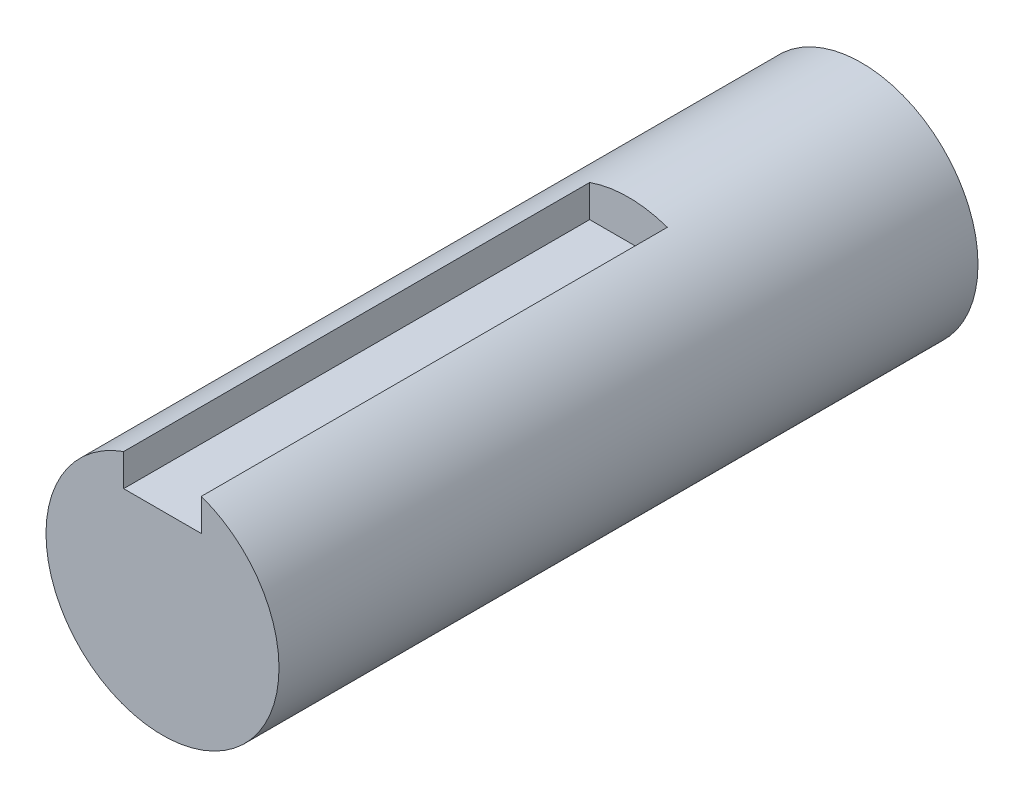
ISO-10303-21;
HEADER;
FILE_DESCRIPTION(('STEP AP214'),'2;1');
FILE_NAME('part.step','',(''),(''),'','','');
FILE_SCHEMA(('AUTOMOTIVE_DESIGN { 1 0 10303 214 1 1 1 1 }'));
ENDSEC;
DATA;
#1=APPLICATION_CONTEXT('core data for automotive mechanical design processes');
#2=APPLICATION_PROTOCOL_DEFINITION('international standard','automotive_design',2000,#1);
#3=PRODUCT_CONTEXT('',#1,'mechanical');
#4=PRODUCT('Part','Part','',(#3));
#5=PRODUCT_RELATED_PRODUCT_CATEGORY('part','',(#4));
#6=PRODUCT_DEFINITION_FORMATION('','',#4);
#7=PRODUCT_DEFINITION_CONTEXT('part definition',#1,'design');
#8=PRODUCT_DEFINITION('design','',#6,#7);
#9=PRODUCT_DEFINITION_SHAPE('','',#8);
#10=(LENGTH_UNIT() NAMED_UNIT(*) SI_UNIT(.MILLI.,.METRE.));
#11=(NAMED_UNIT(*) PLANE_ANGLE_UNIT() SI_UNIT($,.RADIAN.));
#12=(NAMED_UNIT(*) SI_UNIT($,.STERADIAN.) SOLID_ANGLE_UNIT());
#13=UNCERTAINTY_MEASURE_WITH_UNIT(LENGTH_MEASURE(1.E-05),#10,'distance_accuracy_value','');
#14=(GEOMETRIC_REPRESENTATION_CONTEXT(3) GLOBAL_UNCERTAINTY_ASSIGNED_CONTEXT((#13)) GLOBAL_UNIT_ASSIGNED_CONTEXT((#10,
#11,#12)) REPRESENTATION_CONTEXT('',''));
#15=CARTESIAN_POINT('',(0.,0.,0.));
#16=DIRECTION('',(0.,0.,1.));
#17=DIRECTION('',(1.,0.,0.));
#18=AXIS2_PLACEMENT_3D('',#15,#16,#17);
#19=CARTESIAN_POINT('',(0.,0.,45.));
#20=DIRECTION('',(0.,0.,-1.));
#21=DIRECTION('',(-1.,0.,0.));
#22=AXIS2_PLACEMENT_3D('',#19,#20,#21);
#23=CYLINDRICAL_SURFACE('',#22,7.5);
#24=CARTESIAN_POINT('',(0.,0.,15.));
#25=DIRECTION('',(0.,0.,-1.));
#26=DIRECTION('',(-1.,0.,0.));
#27=AXIS2_PLACEMENT_3D('',#24,#25,#26);
#28=CIRCLE('',#27,7.5);
#29=CARTESIAN_POINT('',(-2.5,7.07106781186548,15.));
#30=VERTEX_POINT('',#29);
#31=CARTESIAN_POINT('',(2.5,7.07106781186548,15.));
#32=VERTEX_POINT('',#31);
#33=EDGE_CURVE('E11',#30,#32,#28,.T.);
#34=ORIENTED_EDGE('',*,*,#33,.T.);
#35=DIRECTION('',(0.,0.,-1.));
#36=VECTOR('',#35,1.);
#37=CARTESIAN_POINT('',(2.5,7.07106781186547,45.));
#38=LINE('',#37,#36);
#39=CARTESIAN_POINT('',(2.5,7.07106781186548,45.));
#40=VERTEX_POINT('',#39);
#41=EDGE_CURVE('E61',#32,#40,#38,.F.);
#42=ORIENTED_EDGE('',*,*,#41,.T.);
#43=CARTESIAN_POINT('',(0.,0.,45.));
#44=DIRECTION('',(0.,0.,1.));
#45=DIRECTION('',(1.,0.,0.));
#46=AXIS2_PLACEMENT_3D('',#43,#44,#45);
#47=CIRCLE('',#46,7.5);
#48=CARTESIAN_POINT('',(-2.5,7.07106781186548,45.));
#49=VERTEX_POINT('',#48);
#50=EDGE_CURVE('E107',#49,#40,#47,.T.);
#51=ORIENTED_EDGE('',*,*,#50,.F.);
#52=DIRECTION('',(0.,0.,-1.));
#53=VECTOR('',#52,1.);
#54=CARTESIAN_POINT('',(-2.5,7.07106781186547,45.));
#55=LINE('',#54,#53);
#56=EDGE_CURVE('E53',#49,#30,#55,.T.);
#57=ORIENTED_EDGE('',*,*,#56,.T.);
#58=EDGE_LOOP('',(#34,#42,#51,#57));
#59=FACE_BOUND('',#58,.T.);
#60=CARTESIAN_POINT('',(0.,0.,0.));
#61=DIRECTION('',(0.,0.,1.));
#62=DIRECTION('',(1.,0.,0.));
#63=AXIS2_PLACEMENT_3D('',#60,#61,#62);
#64=CIRCLE('',#63,7.5);
#65=CARTESIAN_POINT('',(7.5,0.,0.));
#66=VERTEX_POINT('',#65);
#67=EDGE_CURVE('E106',#66,#66,#64,.T.);
#68=ORIENTED_EDGE('',*,*,#67,.T.);
#69=EDGE_LOOP('',(#68));
#70=FACE_BOUND('',#69,.T.);
#71=ADVANCED_FACE('F39',(#59,#70),#23,.T.);
#72=CARTESIAN_POINT('',(0.,0.,45.));
#73=DIRECTION('',(0.,0.,1.));
#74=DIRECTION('',(1.,0.,0.));
#75=AXIS2_PLACEMENT_3D('',#72,#73,#74);
#76=PLANE('',#75);
#77=DIRECTION('',(0.,1.,0.));
#78=VECTOR('',#77,1.);
#79=CARTESIAN_POINT('',(2.5,5.,45.));
#80=LINE('',#79,#78);
#81=CARTESIAN_POINT('',(2.5,5.,45.));
#82=VERTEX_POINT('',#81);
#83=EDGE_CURVE('E99',#82,#40,#80,.T.);
#84=ORIENTED_EDGE('',*,*,#83,.F.);
#85=DIRECTION('',(1.,0.,0.));
#86=VECTOR('',#85,1.);
#87=CARTESIAN_POINT('',(-2.5,5.,45.));
#88=LINE('',#87,#86);
#89=CARTESIAN_POINT('',(-2.5,5.,45.));
#90=VERTEX_POINT('',#89);
#91=EDGE_CURVE('E101',#90,#82,#88,.T.);
#92=ORIENTED_EDGE('',*,*,#91,.F.);
#93=DIRECTION('',(0.,-1.,0.));
#94=VECTOR('',#93,1.);
#95=CARTESIAN_POINT('',(-2.5,0.,45.));
#96=LINE('',#95,#94);
#97=EDGE_CURVE('E46',#49,#90,#96,.T.);
#98=ORIENTED_EDGE('',*,*,#97,.F.);
#99=ORIENTED_EDGE('',*,*,#50,.T.);
#100=EDGE_LOOP('',(#84,#92,#98,#99));
#101=FACE_BOUND('',#100,.T.);
#102=ADVANCED_FACE('F116',(#101),#76,.T.);
#103=CARTESIAN_POINT('',(0.,0.,0.));
#104=DIRECTION('',(0.,0.,1.));
#105=DIRECTION('',(1.,0.,0.));
#106=AXIS2_PLACEMENT_3D('',#103,#104,#105);
#107=PLANE('',#106);
#108=ORIENTED_EDGE('',*,*,#67,.F.);
#109=EDGE_LOOP('',(#108));
#110=FACE_BOUND('',#109,.T.);
#111=ADVANCED_FACE('F114',(#110),#107,.F.);
#112=CARTESIAN_POINT('',(0.,0.,15.));
#113=DIRECTION('',(0.,0.,-1.));
#114=DIRECTION('',(-1.,0.,0.));
#115=AXIS2_PLACEMENT_3D('',#112,#113,#114);
#116=PLANE('',#115);
#117=DIRECTION('',(0.,-1.,0.));
#118=VECTOR('',#117,1.);
#119=CARTESIAN_POINT('',(-2.5,5.,15.));
#120=LINE('',#119,#118);
#121=CARTESIAN_POINT('',(-2.5,5.,15.));
#122=VERTEX_POINT('',#121);
#123=EDGE_CURVE('E80',#30,#122,#120,.T.);
#124=ORIENTED_EDGE('',*,*,#123,.T.);
#125=DIRECTION('',(1.,0.,0.));
#126=VECTOR('',#125,1.);
#127=CARTESIAN_POINT('',(-2.5,5.,15.));
#128=LINE('',#127,#126);
#129=CARTESIAN_POINT('',(2.5,5.,15.));
#130=VERTEX_POINT('',#129);
#131=EDGE_CURVE('E84',#122,#130,#128,.T.);
#132=ORIENTED_EDGE('',*,*,#131,.T.);
#133=DIRECTION('',(0.,1.,0.));
#134=VECTOR('',#133,1.);
#135=CARTESIAN_POINT('',(2.5,5.,15.));
#136=LINE('',#135,#134);
#137=EDGE_CURVE('E85',#130,#32,#136,.T.);
#138=ORIENTED_EDGE('',*,*,#137,.T.);
#139=ORIENTED_EDGE('',*,*,#33,.F.);
#140=EDGE_LOOP('',(#124,#132,#138,#139));
#141=FACE_BOUND('',#140,.T.);
#142=ADVANCED_FACE('F82',(#141),#116,.F.);
#143=CARTESIAN_POINT('',(2.5,5.,15.));
#144=DIRECTION('',(1.,0.,0.));
#145=DIRECTION('',(0.,0.,-1.));
#146=AXIS2_PLACEMENT_3D('',#143,#144,#145);
#147=PLANE('',#146);
#148=ORIENTED_EDGE('',*,*,#137,.F.);
#149=DIRECTION('',(0.,0.,1.));
#150=VECTOR('',#149,1.);
#151=CARTESIAN_POINT('',(2.5,5.,15.));
#152=LINE('',#151,#150);
#153=EDGE_CURVE('E93',#130,#82,#152,.T.);
#154=ORIENTED_EDGE('',*,*,#153,.T.);
#155=ORIENTED_EDGE('',*,*,#83,.T.);
#156=ORIENTED_EDGE('',*,*,#41,.F.);
#157=EDGE_LOOP('',(#148,#154,#155,#156));
#158=FACE_BOUND('',#157,.T.);
#159=ADVANCED_FACE('F121',(#158),#147,.F.);
#160=CARTESIAN_POINT('',(-2.5,5.,15.));
#161=DIRECTION('',(-1.,0.,0.));
#162=DIRECTION('',(0.,0.,1.));
#163=AXIS2_PLACEMENT_3D('',#160,#161,#162);
#164=PLANE('',#163);
#165=ORIENTED_EDGE('',*,*,#97,.T.);
#166=DIRECTION('',(0.,0.,1.));
#167=VECTOR('',#166,1.);
#168=CARTESIAN_POINT('',(-2.5,5.,15.));
#169=LINE('',#168,#167);
#170=EDGE_CURVE('E88',#122,#90,#169,.T.);
#171=ORIENTED_EDGE('',*,*,#170,.F.);
#172=ORIENTED_EDGE('',*,*,#123,.F.);
#173=ORIENTED_EDGE('',*,*,#56,.F.);
#174=EDGE_LOOP('',(#165,#171,#172,#173));
#175=FACE_BOUND('',#174,.T.);
#176=ADVANCED_FACE('F89',(#175),#164,.F.);
#177=CARTESIAN_POINT('',(-2.5,5.,15.));
#178=DIRECTION('',(0.,-1.,0.));
#179=DIRECTION('',(0.,0.,-1.));
#180=AXIS2_PLACEMENT_3D('',#177,#178,#179);
#181=PLANE('',#180);
#182=ORIENTED_EDGE('',*,*,#91,.T.);
#183=ORIENTED_EDGE('',*,*,#153,.F.);
#184=ORIENTED_EDGE('',*,*,#131,.F.);
#185=ORIENTED_EDGE('',*,*,#170,.T.);
#186=EDGE_LOOP('',(#182,#183,#184,#185));
#187=FACE_BOUND('',#186,.T.);
#188=ADVANCED_FACE('F95',(#187),#181,.F.);
#189=CLOSED_SHELL('',(#71,#102,#111,#142,#159,#176,#188));
#190=MANIFOLD_SOLID_BREP('B2',#189);
#191=ADVANCED_BREP_SHAPE_REPRESENTATION('',(#18,#190),#14);
#192=SHAPE_DEFINITION_REPRESENTATION(#9,#191);
ENDSEC;
END-ISO-10303-21;
